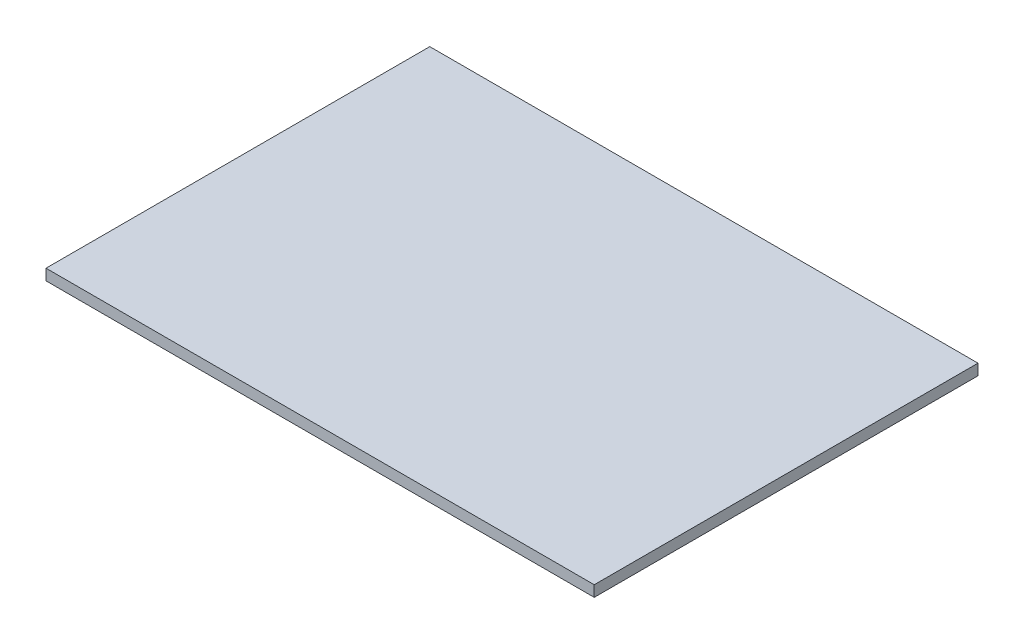
ISO-10303-21;
HEADER;
FILE_DESCRIPTION(('STEP AP214'),'2;1');
FILE_NAME('part.step','',(''),(''),'','','');
FILE_SCHEMA(('AUTOMOTIVE_DESIGN { 1 0 10303 214 1 1 1 1 }'));
ENDSEC;
DATA;
#1=APPLICATION_CONTEXT('core data for automotive mechanical design processes');
#2=APPLICATION_PROTOCOL_DEFINITION('international standard','automotive_design',2000,#1);
#3=PRODUCT_CONTEXT('',#1,'mechanical');
#4=PRODUCT('Part','Part','',(#3));
#5=PRODUCT_RELATED_PRODUCT_CATEGORY('part','',(#4));
#6=PRODUCT_DEFINITION_FORMATION('','',#4);
#7=PRODUCT_DEFINITION_CONTEXT('part definition',#1,'design');
#8=PRODUCT_DEFINITION('design','',#6,#7);
#9=PRODUCT_DEFINITION_SHAPE('','',#8);
#10=(LENGTH_UNIT() NAMED_UNIT(*) SI_UNIT(.MILLI.,.METRE.));
#11=(NAMED_UNIT(*) PLANE_ANGLE_UNIT() SI_UNIT($,.RADIAN.));
#12=(NAMED_UNIT(*) SI_UNIT($,.STERADIAN.) SOLID_ANGLE_UNIT());
#13=UNCERTAINTY_MEASURE_WITH_UNIT(LENGTH_MEASURE(1.E-05),#10,'distance_accuracy_value','');
#14=(GEOMETRIC_REPRESENTATION_CONTEXT(3) GLOBAL_UNCERTAINTY_ASSIGNED_CONTEXT((#13)) GLOBAL_UNIT_ASSIGNED_CONTEXT((#10,
#11,#12)) REPRESENTATION_CONTEXT('',''));
#15=CARTESIAN_POINT('',(0.,0.,0.));
#16=DIRECTION('',(0.,0.,1.));
#17=DIRECTION('',(1.,0.,0.));
#18=AXIS2_PLACEMENT_3D('',#15,#16,#17);
#19=CARTESIAN_POINT('',(0.,0.,175.));
#20=DIRECTION('',(1.,0.,0.));
#21=DIRECTION('',(0.,1.,0.));
#22=AXIS2_PLACEMENT_3D('',#19,#20,#21);
#23=PLANE('',#22);
#24=DIRECTION('',(0.,-1.,0.));
#25=VECTOR('',#24,1.);
#26=CARTESIAN_POINT('',(0.,0.,-175.));
#27=LINE('',#26,#25);
#28=CARTESIAN_POINT('',(0.,0.,-175.));
#29=VERTEX_POINT('',#28);
#30=CARTESIAN_POINT('',(0.,-9.99999999999999,-175.));
#31=VERTEX_POINT('',#30);
#32=EDGE_CURVE('E100',#29,#31,#27,.T.);
#33=ORIENTED_EDGE('',*,*,#32,.T.);
#34=DIRECTION('',(0.,0.,-1.));
#35=VECTOR('',#34,1.);
#36=CARTESIAN_POINT('',(0.,-9.99999999999999,175.));
#37=LINE('',#36,#35);
#38=CARTESIAN_POINT('',(0.,-9.99999999999999,175.));
#39=VERTEX_POINT('',#38);
#40=EDGE_CURVE('E11',#39,#31,#37,.T.);
#41=ORIENTED_EDGE('',*,*,#40,.F.);
#42=DIRECTION('',(0.,-1.,0.));
#43=VECTOR('',#42,1.);
#44=CARTESIAN_POINT('',(0.,0.,175.));
#45=LINE('',#44,#43);
#46=CARTESIAN_POINT('',(0.,0.,175.));
#47=VERTEX_POINT('',#46);
#48=EDGE_CURVE('E88',#47,#39,#45,.T.);
#49=ORIENTED_EDGE('',*,*,#48,.F.);
#50=DIRECTION('',(0.,0.,-1.));
#51=VECTOR('',#50,1.);
#52=CARTESIAN_POINT('',(0.,0.,175.));
#53=LINE('',#52,#51);
#54=EDGE_CURVE('E96',#47,#29,#53,.T.);
#55=ORIENTED_EDGE('',*,*,#54,.T.);
#56=EDGE_LOOP('',(#33,#41,#49,#55));
#57=FACE_BOUND('',#56,.T.);
#58=ADVANCED_FACE('F37',(#57),#23,.F.);
#59=CARTESIAN_POINT('',(0.,-9.99999999999999,175.));
#60=DIRECTION('',(0.,1.,0.));
#61=DIRECTION('',(0.,0.,1.));
#62=AXIS2_PLACEMENT_3D('',#59,#60,#61);
#63=PLANE('',#62);
#64=DIRECTION('',(1.,0.,0.));
#65=VECTOR('',#64,1.);
#66=CARTESIAN_POINT('',(0.,-9.99999999999999,-175.));
#67=LINE('',#66,#65);
#68=CARTESIAN_POINT('',(500.,-9.99999999999999,-175.));
#69=VERTEX_POINT('',#68);
#70=EDGE_CURVE('E92',#31,#69,#67,.T.);
#71=ORIENTED_EDGE('',*,*,#70,.T.);
#72=DIRECTION('',(0.,0.,-1.));
#73=VECTOR('',#72,1.);
#74=CARTESIAN_POINT('',(500.,-9.99999999999999,175.));
#75=LINE('',#74,#73);
#76=CARTESIAN_POINT('',(500.,-9.99999999999999,175.));
#77=VERTEX_POINT('',#76);
#78=EDGE_CURVE('E45',#77,#69,#75,.T.);
#79=ORIENTED_EDGE('',*,*,#78,.F.);
#80=DIRECTION('',(1.,0.,0.));
#81=VECTOR('',#80,1.);
#82=CARTESIAN_POINT('',(0.,-9.99999999999999,175.));
#83=LINE('',#82,#81);
#84=EDGE_CURVE('E83',#39,#77,#83,.T.);
#85=ORIENTED_EDGE('',*,*,#84,.F.);
#86=ORIENTED_EDGE('',*,*,#40,.T.);
#87=EDGE_LOOP('',(#71,#79,#85,#86));
#88=FACE_BOUND('',#87,.T.);
#89=ADVANCED_FACE('F91',(#88),#63,.F.);
#90=CARTESIAN_POINT('',(500.,0.,175.));
#91=DIRECTION('',(-1.,0.,0.));
#92=DIRECTION('',(0.,0.,1.));
#93=AXIS2_PLACEMENT_3D('',#90,#91,#92);
#94=PLANE('',#93);
#95=DIRECTION('',(0.,1.,0.));
#96=VECTOR('',#95,1.);
#97=CARTESIAN_POINT('',(500.,0.,-175.));
#98=LINE('',#97,#96);
#99=CARTESIAN_POINT('',(500.,0.,-175.));
#100=VERTEX_POINT('',#99);
#101=EDGE_CURVE('E70',#69,#100,#98,.T.);
#102=ORIENTED_EDGE('',*,*,#101,.T.);
#103=DIRECTION('',(0.,0.,-1.));
#104=VECTOR('',#103,1.);
#105=CARTESIAN_POINT('',(500.,0.,175.));
#106=LINE('',#105,#104);
#107=CARTESIAN_POINT('',(500.,0.,175.));
#108=VERTEX_POINT('',#107);
#109=EDGE_CURVE('E93',#108,#100,#106,.T.);
#110=ORIENTED_EDGE('',*,*,#109,.F.);
#111=DIRECTION('',(0.,1.,0.));
#112=VECTOR('',#111,1.);
#113=CARTESIAN_POINT('',(500.,0.,175.));
#114=LINE('',#113,#112);
#115=EDGE_CURVE('E86',#77,#108,#114,.T.);
#116=ORIENTED_EDGE('',*,*,#115,.F.);
#117=ORIENTED_EDGE('',*,*,#78,.T.);
#118=EDGE_LOOP('',(#102,#110,#116,#117));
#119=FACE_BOUND('',#118,.T.);
#120=ADVANCED_FACE('F94',(#119),#94,.F.);
#121=CARTESIAN_POINT('',(0.,0.,175.));
#122=DIRECTION('',(0.,-1.,0.));
#123=DIRECTION('',(0.,0.,-1.));
#124=AXIS2_PLACEMENT_3D('',#121,#122,#123);
#125=PLANE('',#124);
#126=DIRECTION('',(-1.,0.,0.));
#127=VECTOR('',#126,1.);
#128=CARTESIAN_POINT('',(0.,0.,-175.));
#129=LINE('',#128,#127);
#130=EDGE_CURVE('E76',#100,#29,#129,.T.);
#131=ORIENTED_EDGE('',*,*,#130,.T.);
#132=ORIENTED_EDGE('',*,*,#54,.F.);
#133=DIRECTION('',(-1.,0.,0.));
#134=VECTOR('',#133,1.);
#135=CARTESIAN_POINT('',(0.,0.,175.));
#136=LINE('',#135,#134);
#137=EDGE_CURVE('E53',#108,#47,#136,.T.);
#138=ORIENTED_EDGE('',*,*,#137,.F.);
#139=ORIENTED_EDGE('',*,*,#109,.T.);
#140=EDGE_LOOP('',(#131,#132,#138,#139));
#141=FACE_BOUND('',#140,.T.);
#142=ADVANCED_FACE('F107',(#141),#125,.F.);
#143=CARTESIAN_POINT('',(0.,0.,175.));
#144=DIRECTION('',(0.,0.,1.));
#145=DIRECTION('',(1.,0.,0.));
#146=AXIS2_PLACEMENT_3D('',#143,#144,#145);
#147=PLANE('',#146);
#148=ORIENTED_EDGE('',*,*,#48,.T.);
#149=ORIENTED_EDGE('',*,*,#84,.T.);
#150=ORIENTED_EDGE('',*,*,#115,.T.);
#151=ORIENTED_EDGE('',*,*,#137,.T.);
#152=EDGE_LOOP('',(#148,#149,#150,#151));
#153=FACE_BOUND('',#152,.T.);
#154=ADVANCED_FACE('F84',(#153),#147,.T.);
#155=CARTESIAN_POINT('',(0.,0.,-175.));
#156=DIRECTION('',(0.,0.,1.));
#157=DIRECTION('',(1.,0.,0.));
#158=AXIS2_PLACEMENT_3D('',#155,#156,#157);
#159=PLANE('',#158);
#160=ORIENTED_EDGE('',*,*,#32,.F.);
#161=ORIENTED_EDGE('',*,*,#130,.F.);
#162=ORIENTED_EDGE('',*,*,#101,.F.);
#163=ORIENTED_EDGE('',*,*,#70,.F.);
#164=EDGE_LOOP('',(#160,#161,#162,#163));
#165=FACE_BOUND('',#164,.T.);
#166=ADVANCED_FACE('F110',(#165),#159,.F.);
#167=CLOSED_SHELL('',(#58,#89,#120,#142,#154,#166));
#168=MANIFOLD_SOLID_BREP('B2',#167);
#169=ADVANCED_BREP_SHAPE_REPRESENTATION('',(#18,#168),#14);
#170=SHAPE_DEFINITION_REPRESENTATION(#9,#169);
ENDSEC;
END-ISO-10303-21;
